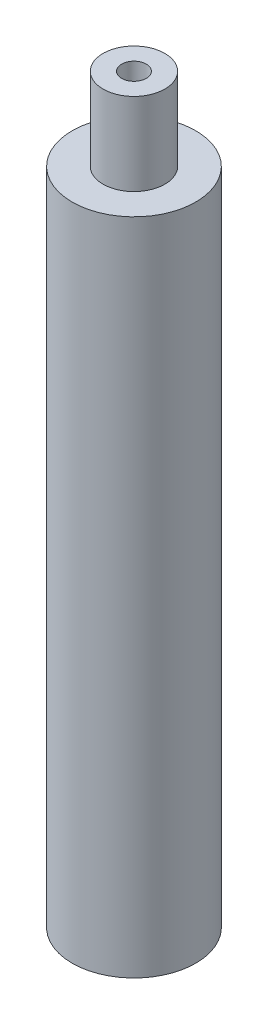
ISO-10303-21;
HEADER;
FILE_DESCRIPTION(('STEP AP214'),'2;1');
FILE_NAME('part.step','',(''),(''),'','','');
FILE_SCHEMA(('AUTOMOTIVE_DESIGN { 1 0 10303 214 1 1 1 1 }'));
ENDSEC;
DATA;
#1=APPLICATION_CONTEXT('core data for automotive mechanical design processes');
#2=APPLICATION_PROTOCOL_DEFINITION('international standard','automotive_design',2000,#1);
#3=PRODUCT_CONTEXT('',#1,'mechanical');
#4=PRODUCT('Part','Part','',(#3));
#5=PRODUCT_RELATED_PRODUCT_CATEGORY('part','',(#4));
#6=PRODUCT_DEFINITION_FORMATION('','',#4);
#7=PRODUCT_DEFINITION_CONTEXT('part definition',#1,'design');
#8=PRODUCT_DEFINITION('design','',#6,#7);
#9=PRODUCT_DEFINITION_SHAPE('','',#8);
#10=(LENGTH_UNIT() NAMED_UNIT(*) SI_UNIT(.MILLI.,.METRE.));
#11=(NAMED_UNIT(*) PLANE_ANGLE_UNIT() SI_UNIT($,.RADIAN.));
#12=(NAMED_UNIT(*) SI_UNIT($,.STERADIAN.) SOLID_ANGLE_UNIT());
#13=UNCERTAINTY_MEASURE_WITH_UNIT(LENGTH_MEASURE(1.E-05),#10,'distance_accuracy_value','');
#14=(GEOMETRIC_REPRESENTATION_CONTEXT(3) GLOBAL_UNCERTAINTY_ASSIGNED_CONTEXT((#13)) GLOBAL_UNIT_ASSIGNED_CONTEXT((#10,
#11,#12)) REPRESENTATION_CONTEXT('',''));
#15=CARTESIAN_POINT('',(0.,0.,0.));
#16=DIRECTION('',(0.,0.,1.));
#17=DIRECTION('',(1.,0.,0.));
#18=AXIS2_PLACEMENT_3D('',#15,#16,#17);
#19=CARTESIAN_POINT('',(0.,101.6,0.));
#20=DIRECTION('',(0.,-1.,0.));
#21=DIRECTION('',(0.,0.,-1.));
#22=AXIS2_PLACEMENT_3D('',#19,#20,#21);
#23=CYLINDRICAL_SURFACE('',#22,9.525);
#24=CARTESIAN_POINT('',(0.,101.6,0.));
#25=DIRECTION('',(0.,1.,0.));
#26=DIRECTION('',(0.,0.,1.));
#27=AXIS2_PLACEMENT_3D('',#24,#25,#26);
#28=CIRCLE('',#27,9.525);
#29=CARTESIAN_POINT('',(0.,101.6,9.525));
#30=VERTEX_POINT('',#29);
#31=EDGE_CURVE('E45',#30,#30,#28,.T.);
#32=ORIENTED_EDGE('',*,*,#31,.F.);
#33=EDGE_LOOP('',(#32));
#34=FACE_BOUND('',#33,.T.);
#35=CARTESIAN_POINT('',(0.,0.,0.));
#36=DIRECTION('',(0.,1.,0.));
#37=DIRECTION('',(0.,0.,1.));
#38=AXIS2_PLACEMENT_3D('',#35,#36,#37);
#39=CIRCLE('',#38,9.525);
#40=CARTESIAN_POINT('',(0.,0.,9.525));
#41=VERTEX_POINT('',#40);
#42=EDGE_CURVE('E40',#41,#41,#39,.T.);
#43=ORIENTED_EDGE('',*,*,#42,.T.);
#44=EDGE_LOOP('',(#43));
#45=FACE_BOUND('',#44,.T.);
#46=ADVANCED_FACE('F37',(#34,#45),#23,.T.);
#47=CARTESIAN_POINT('',(0.,101.6,0.));
#48=DIRECTION('',(0.,1.,0.));
#49=DIRECTION('',(0.,0.,1.));
#50=AXIS2_PLACEMENT_3D('',#47,#48,#49);
#51=PLANE('',#50);
#52=CARTESIAN_POINT('',(0.,101.6,0.));
#53=DIRECTION('',(0.,1.,0.));
#54=DIRECTION('',(0.,0.,1.));
#55=AXIS2_PLACEMENT_3D('',#52,#53,#54);
#56=CIRCLE('',#55,4.7625);
#57=CARTESIAN_POINT('',(0.,101.6,4.7625));
#58=VERTEX_POINT('',#57);
#59=EDGE_CURVE('E10',#58,#58,#56,.T.);
#60=ORIENTED_EDGE('',*,*,#59,.F.);
#61=EDGE_LOOP('',(#60));
#62=FACE_BOUND('',#61,.T.);
#63=ORIENTED_EDGE('',*,*,#31,.T.);
#64=EDGE_LOOP('',(#63));
#65=FACE_BOUND('',#64,.T.);
#66=ADVANCED_FACE('F98',(#62,#65),#51,.T.);
#67=CARTESIAN_POINT('',(0.,0.,0.));
#68=DIRECTION('',(0.,1.,0.));
#69=DIRECTION('',(0.,0.,1.));
#70=AXIS2_PLACEMENT_3D('',#67,#68,#69);
#71=PLANE('',#70);
#72=CARTESIAN_POINT('',(0.,0.,0.));
#73=DIRECTION('',(0.,-1.,0.));
#74=DIRECTION('',(0.,0.,-1.));
#75=AXIS2_PLACEMENT_3D('',#72,#73,#74);
#76=CIRCLE('',#75,5.7546875);
#77=CARTESIAN_POINT('',(0.,0.,-5.7546875));
#78=VERTEX_POINT('',#77);
#79=EDGE_CURVE('E57',#78,#78,#76,.T.);
#80=ORIENTED_EDGE('',*,*,#79,.F.);
#81=EDGE_LOOP('',(#80));
#82=FACE_BOUND('',#81,.T.);
#83=ORIENTED_EDGE('',*,*,#42,.F.);
#84=EDGE_LOOP('',(#83));
#85=FACE_BOUND('',#84,.T.);
#86=ADVANCED_FACE('F94',(#82,#85),#71,.F.);
#87=CARTESIAN_POINT('',(0.,114.3,0.));
#88=DIRECTION('',(0.,-1.,0.));
#89=DIRECTION('',(0.,0.,-1.));
#90=AXIS2_PLACEMENT_3D('',#87,#88,#89);
#91=CYLINDRICAL_SURFACE('',#90,4.7625);
#92=CARTESIAN_POINT('',(0.,114.3,0.));
#93=DIRECTION('',(0.,1.,0.));
#94=DIRECTION('',(0.,0.,1.));
#95=AXIS2_PLACEMENT_3D('',#92,#93,#94);
#96=CIRCLE('',#95,4.7625);
#97=CARTESIAN_POINT('',(0.,114.3,4.7625));
#98=VERTEX_POINT('',#97);
#99=EDGE_CURVE('E52',#98,#98,#96,.T.);
#100=ORIENTED_EDGE('',*,*,#99,.F.);
#101=EDGE_LOOP('',(#100));
#102=FACE_BOUND('',#101,.T.);
#103=ORIENTED_EDGE('',*,*,#59,.T.);
#104=EDGE_LOOP('',(#103));
#105=FACE_BOUND('',#104,.T.);
#106=ADVANCED_FACE('F97',(#102,#105),#91,.T.);
#107=CARTESIAN_POINT('',(0.,114.3,0.));
#108=DIRECTION('',(0.,1.,0.));
#109=DIRECTION('',(0.,0.,1.));
#110=AXIS2_PLACEMENT_3D('',#107,#108,#109);
#111=PLANE('',#110);
#112=CARTESIAN_POINT('',(0.,114.3,0.));
#113=DIRECTION('',(0.,-1.,0.));
#114=DIRECTION('',(0.,0.,-1.));
#115=AXIS2_PLACEMENT_3D('',#112,#113,#114);
#116=CIRCLE('',#115,1.905);
#117=CARTESIAN_POINT('',(0.,114.3,-1.905));
#118=VERTEX_POINT('',#117);
#119=EDGE_CURVE('E61',#118,#118,#116,.T.);
#120=ORIENTED_EDGE('',*,*,#119,.T.);
#121=EDGE_LOOP('',(#120));
#122=FACE_BOUND('',#121,.T.);
#123=ORIENTED_EDGE('',*,*,#99,.T.);
#124=EDGE_LOOP('',(#123));
#125=FACE_BOUND('',#124,.T.);
#126=ADVANCED_FACE('F73',(#122,#125),#111,.T.);
#127=CARTESIAN_POINT('',(0.,25.4,0.));
#128=DIRECTION('',(0.,-1.,0.));
#129=DIRECTION('',(0.,0.,-1.));
#130=AXIS2_PLACEMENT_3D('',#127,#128,#129);
#131=CYLINDRICAL_SURFACE('',#130,5.7546875);
#132=CARTESIAN_POINT('',(0.,25.4,0.));
#133=DIRECTION('',(0.,-1.,0.));
#134=DIRECTION('',(0.,0.,-1.));
#135=AXIS2_PLACEMENT_3D('',#132,#133,#134);
#136=CIRCLE('',#135,5.7546875);
#137=CARTESIAN_POINT('',(0.,25.4,-5.7546875));
#138=VERTEX_POINT('',#137);
#139=EDGE_CURVE('E56',#138,#138,#136,.T.);
#140=ORIENTED_EDGE('',*,*,#139,.F.);
#141=EDGE_LOOP('',(#140));
#142=FACE_BOUND('',#141,.T.);
#143=ORIENTED_EDGE('',*,*,#79,.T.);
#144=EDGE_LOOP('',(#143));
#145=FACE_BOUND('',#144,.T.);
#146=ADVANCED_FACE('F85',(#142,#145),#131,.F.);
#147=CARTESIAN_POINT('',(0.,25.4,0.));
#148=DIRECTION('',(0.,-1.,0.));
#149=DIRECTION('',(0.,0.,-1.));
#150=AXIS2_PLACEMENT_3D('',#147,#148,#149);
#151=PLANE('',#150);
#152=CARTESIAN_POINT('',(0.,25.4,0.));
#153=DIRECTION('',(0.,-1.,0.));
#154=DIRECTION('',(0.,0.,-1.));
#155=AXIS2_PLACEMENT_3D('',#152,#153,#154);
#156=CIRCLE('',#155,1.905);
#157=CARTESIAN_POINT('',(0.,25.4,-1.905));
#158=VERTEX_POINT('',#157);
#159=EDGE_CURVE('E65',#158,#158,#156,.T.);
#160=ORIENTED_EDGE('',*,*,#159,.F.);
#161=EDGE_LOOP('',(#160));
#162=FACE_BOUND('',#161,.T.);
#163=ORIENTED_EDGE('',*,*,#139,.T.);
#164=EDGE_LOOP('',(#163));
#165=FACE_BOUND('',#164,.T.);
#166=ADVANCED_FACE('F79',(#162,#165),#151,.T.);
#167=CARTESIAN_POINT('',(0.,114.3,0.));
#168=DIRECTION('',(0.,-1.,0.));
#169=DIRECTION('',(0.,0.,-1.));
#170=AXIS2_PLACEMENT_3D('',#167,#168,#169);
#171=CYLINDRICAL_SURFACE('',#170,1.905);
#172=ORIENTED_EDGE('',*,*,#119,.F.);
#173=EDGE_LOOP('',(#172));
#174=FACE_BOUND('',#173,.T.);
#175=ORIENTED_EDGE('',*,*,#159,.T.);
#176=EDGE_LOOP('',(#175));
#177=FACE_BOUND('',#176,.T.);
#178=ADVANCED_FACE('F76',(#174,#177),#171,.F.);
#179=CLOSED_SHELL('',(#46,#66,#86,#106,#126,#146,#166,#178));
#180=MANIFOLD_SOLID_BREP('B2',#179);
#181=ADVANCED_BREP_SHAPE_REPRESENTATION('',(#18,#180),#14);
#182=SHAPE_DEFINITION_REPRESENTATION(#9,#181);
ENDSEC;
END-ISO-10303-21;
